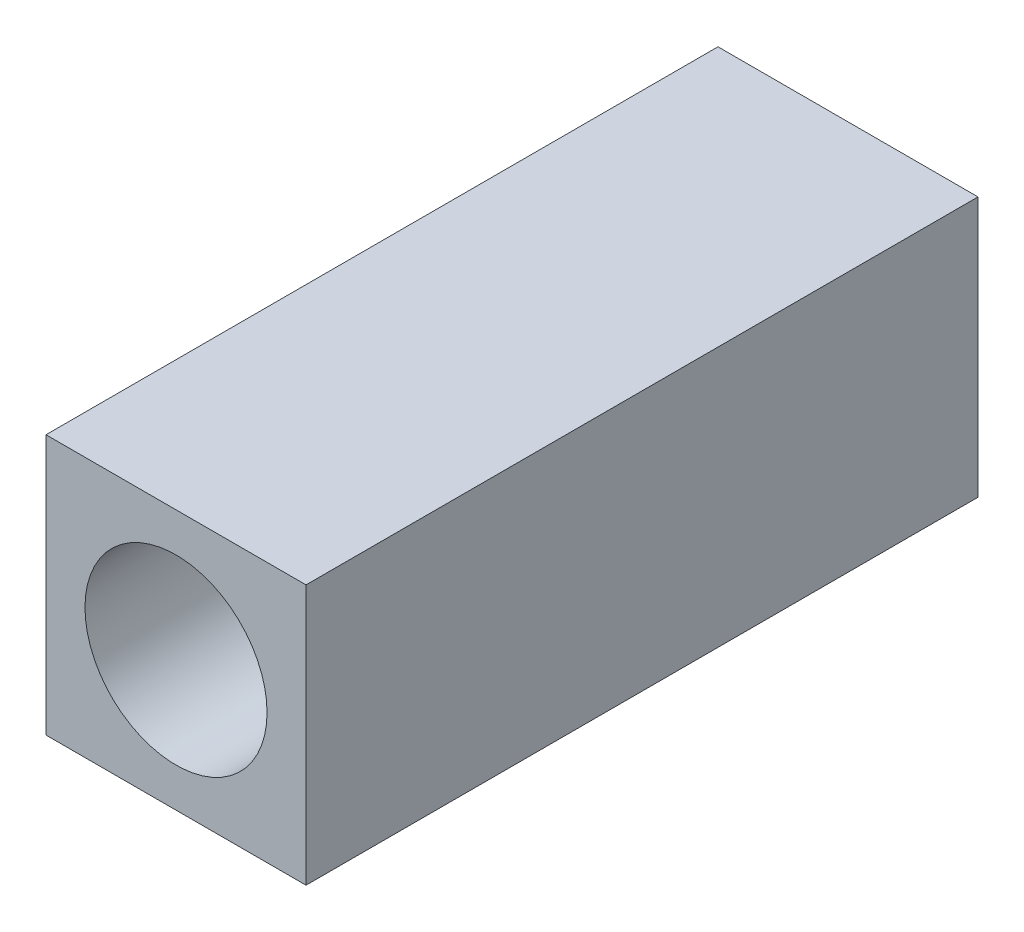
ISO-10303-21;
HEADER;
FILE_DESCRIPTION(('STEP AP214'),'2;1');
FILE_NAME('part.step','',(''),(''),'','','');
FILE_SCHEMA(('AUTOMOTIVE_DESIGN { 1 0 10303 214 1 1 1 1 }'));
ENDSEC;
DATA;
#1=APPLICATION_CONTEXT('core data for automotive mechanical design processes');
#2=APPLICATION_PROTOCOL_DEFINITION('international standard','automotive_design',2000,#1);
#3=PRODUCT_CONTEXT('',#1,'mechanical');
#4=PRODUCT('Part','Part','',(#3));
#5=PRODUCT_RELATED_PRODUCT_CATEGORY('part','',(#4));
#6=PRODUCT_DEFINITION_FORMATION('','',#4);
#7=PRODUCT_DEFINITION_CONTEXT('part definition',#1,'design');
#8=PRODUCT_DEFINITION('design','',#6,#7);
#9=PRODUCT_DEFINITION_SHAPE('','',#8);
#10=(LENGTH_UNIT() NAMED_UNIT(*) SI_UNIT(.MILLI.,.METRE.));
#11=(NAMED_UNIT(*) PLANE_ANGLE_UNIT() SI_UNIT($,.RADIAN.));
#12=(NAMED_UNIT(*) SI_UNIT($,.STERADIAN.) SOLID_ANGLE_UNIT());
#13=UNCERTAINTY_MEASURE_WITH_UNIT(LENGTH_MEASURE(1.E-05),#10,'distance_accuracy_value','');
#14=(GEOMETRIC_REPRESENTATION_CONTEXT(3) GLOBAL_UNCERTAINTY_ASSIGNED_CONTEXT((#13)) GLOBAL_UNIT_ASSIGNED_CONTEXT((#10,
#11,#12)) REPRESENTATION_CONTEXT('',''));
#15=CARTESIAN_POINT('',(0.,0.,0.));
#16=DIRECTION('',(0.,0.,1.));
#17=DIRECTION('',(1.,0.,0.));
#18=AXIS2_PLACEMENT_3D('',#15,#16,#17);
#19=CARTESIAN_POINT('',(-2.99895518302224,0.,16.));
#20=DIRECTION('',(-1.,0.,0.));
#21=DIRECTION('',(0.,0.,1.));
#22=AXIS2_PLACEMENT_3D('',#19,#20,#21);
#23=PLANE('',#22);
#24=DIRECTION('',(0.,0.,-1.));
#25=VECTOR('',#24,1.);
#26=CARTESIAN_POINT('',(-2.99895518302224,3.,16.));
#27=LINE('',#26,#25);
#28=CARTESIAN_POINT('',(-2.99895518302224,3.,16.));
#29=VERTEX_POINT('',#28);
#30=CARTESIAN_POINT('',(-2.99895518302224,3.,0.5));
#31=VERTEX_POINT('',#30);
#32=EDGE_CURVE('E120',#29,#31,#27,.T.);
#33=ORIENTED_EDGE('',*,*,#32,.T.);
#34=DIRECTION('',(0.,-1.,0.));
#35=VECTOR('',#34,1.);
#36=CARTESIAN_POINT('',(-2.99895518302224,-3.,0.5));
#37=LINE('',#36,#35);
#38=CARTESIAN_POINT('',(-2.99895518302224,-3.,0.5));
#39=VERTEX_POINT('',#38);
#40=EDGE_CURVE('E138',#31,#39,#37,.T.);
#41=ORIENTED_EDGE('',*,*,#40,.T.);
#42=DIRECTION('',(0.,0.,-1.));
#43=VECTOR('',#42,1.);
#44=CARTESIAN_POINT('',(-2.99895518302224,-3.,16.));
#45=LINE('',#44,#43);
#46=CARTESIAN_POINT('',(-2.99895518302224,-3.,16.));
#47=VERTEX_POINT('',#46);
#48=EDGE_CURVE('E127',#47,#39,#45,.T.);
#49=ORIENTED_EDGE('',*,*,#48,.F.);
#50=DIRECTION('',(0.,1.,0.));
#51=VECTOR('',#50,1.);
#52=CARTESIAN_POINT('',(-2.99895518302224,0.,16.));
#53=LINE('',#52,#51);
#54=EDGE_CURVE('E105',#47,#29,#53,.T.);
#55=ORIENTED_EDGE('',*,*,#54,.T.);
#56=EDGE_LOOP('',(#33,#41,#49,#55));
#57=FACE_BOUND('',#56,.T.);
#58=ADVANCED_FACE('F38',(#57),#23,.T.);
#59=CARTESIAN_POINT('',(0.,-3.,16.));
#60=DIRECTION('',(0.,1.,0.));
#61=DIRECTION('',(0.,0.,1.));
#62=AXIS2_PLACEMENT_3D('',#59,#60,#61);
#63=PLANE('',#62);
#64=ORIENTED_EDGE('',*,*,#48,.T.);
#65=DIRECTION('',(1.,0.,0.));
#66=VECTOR('',#65,1.);
#67=CARTESIAN_POINT('',(0.,-3.,0.5));
#68=LINE('',#67,#66);
#69=CARTESIAN_POINT('',(2.99895518302224,-3.,0.5));
#70=VERTEX_POINT('',#69);
#71=EDGE_CURVE('E62',#39,#70,#68,.T.);
#72=ORIENTED_EDGE('',*,*,#71,.T.);
#73=DIRECTION('',(0.,0.,-1.));
#74=VECTOR('',#73,1.);
#75=CARTESIAN_POINT('',(2.99895518302224,-3.,16.));
#76=LINE('',#75,#74);
#77=CARTESIAN_POINT('',(2.99895518302224,-3.,16.));
#78=VERTEX_POINT('',#77);
#79=EDGE_CURVE('E125',#78,#70,#76,.T.);
#80=ORIENTED_EDGE('',*,*,#79,.F.);
#81=DIRECTION('',(1.,0.,0.));
#82=VECTOR('',#81,1.);
#83=CARTESIAN_POINT('',(0.,-3.,16.));
#84=LINE('',#83,#82);
#85=EDGE_CURVE('E109',#47,#78,#84,.T.);
#86=ORIENTED_EDGE('',*,*,#85,.F.);
#87=EDGE_LOOP('',(#64,#72,#80,#86));
#88=FACE_BOUND('',#87,.T.);
#89=ADVANCED_FACE('F182',(#88),#63,.F.);
#90=CARTESIAN_POINT('',(2.99895518302224,0.,16.));
#91=DIRECTION('',(-1.,0.,0.));
#92=DIRECTION('',(0.,0.,1.));
#93=AXIS2_PLACEMENT_3D('',#90,#91,#92);
#94=PLANE('',#93);
#95=ORIENTED_EDGE('',*,*,#79,.T.);
#96=DIRECTION('',(0.,1.,0.));
#97=VECTOR('',#96,1.);
#98=CARTESIAN_POINT('',(2.99895518302224,0.,0.5));
#99=LINE('',#98,#97);
#100=CARTESIAN_POINT('',(2.99895518302224,3.,0.5));
#101=VERTEX_POINT('',#100);
#102=EDGE_CURVE('E47',#70,#101,#99,.T.);
#103=ORIENTED_EDGE('',*,*,#102,.T.);
#104=DIRECTION('',(0.,0.,-1.));
#105=VECTOR('',#104,1.);
#106=CARTESIAN_POINT('',(2.99895518302224,3.,16.));
#107=LINE('',#106,#105);
#108=CARTESIAN_POINT('',(2.99895518302224,3.,16.));
#109=VERTEX_POINT('',#108);
#110=EDGE_CURVE('E123',#109,#101,#107,.T.);
#111=ORIENTED_EDGE('',*,*,#110,.F.);
#112=DIRECTION('',(0.,1.,0.));
#113=VECTOR('',#112,1.);
#114=CARTESIAN_POINT('',(2.99895518302224,0.,16.));
#115=LINE('',#114,#113);
#116=EDGE_CURVE('E115',#78,#109,#115,.T.);
#117=ORIENTED_EDGE('',*,*,#116,.F.);
#118=EDGE_LOOP('',(#95,#103,#111,#117));
#119=FACE_BOUND('',#118,.T.);
#120=ADVANCED_FACE('F187',(#119),#94,.F.);
#121=CARTESIAN_POINT('',(0.,3.,16.));
#122=DIRECTION('',(0.,1.,0.));
#123=DIRECTION('',(0.,0.,1.));
#124=AXIS2_PLACEMENT_3D('',#121,#122,#123);
#125=PLANE('',#124);
#126=ORIENTED_EDGE('',*,*,#110,.T.);
#127=DIRECTION('',(-1.,0.,0.));
#128=VECTOR('',#127,1.);
#129=CARTESIAN_POINT('',(-2.99895518302224,3.,0.5));
#130=LINE('',#129,#128);
#131=EDGE_CURVE('E11',#101,#31,#130,.T.);
#132=ORIENTED_EDGE('',*,*,#131,.T.);
#133=ORIENTED_EDGE('',*,*,#32,.F.);
#134=DIRECTION('',(1.,0.,0.));
#135=VECTOR('',#134,1.);
#136=CARTESIAN_POINT('',(0.,3.,16.));
#137=LINE('',#136,#135);
#138=EDGE_CURVE('E117',#29,#109,#137,.T.);
#139=ORIENTED_EDGE('',*,*,#138,.T.);
#140=EDGE_LOOP('',(#126,#132,#133,#139));
#141=FACE_BOUND('',#140,.T.);
#142=ADVANCED_FACE('F163',(#141),#125,.T.);
#143=CARTESIAN_POINT('',(0.,0.,16.));
#144=DIRECTION('',(0.,0.,1.));
#145=DIRECTION('',(1.,0.,0.));
#146=AXIS2_PLACEMENT_3D('',#143,#144,#145);
#147=PLANE('',#146);
#148=CARTESIAN_POINT('',(0.,0.,16.));
#149=DIRECTION('',(0.,0.,1.));
#150=DIRECTION('',(1.,0.,0.));
#151=AXIS2_PLACEMENT_3D('',#148,#149,#150);
#152=CIRCLE('',#151,2.09999999999999);
#153=CARTESIAN_POINT('',(2.09999999999999,0.,16.));
#154=VERTEX_POINT('',#153);
#155=EDGE_CURVE('E106',#154,#154,#152,.T.);
#156=ORIENTED_EDGE('',*,*,#155,.F.);
#157=EDGE_LOOP('',(#156));
#158=FACE_BOUND('',#157,.T.);
#159=ORIENTED_EDGE('',*,*,#54,.F.);
#160=ORIENTED_EDGE('',*,*,#85,.T.);
#161=ORIENTED_EDGE('',*,*,#116,.T.);
#162=ORIENTED_EDGE('',*,*,#138,.F.);
#163=EDGE_LOOP('',(#159,#160,#161,#162));
#164=FACE_BOUND('',#163,.T.);
#165=ADVANCED_FACE('F173',(#158,#164),#147,.T.);
#166=CARTESIAN_POINT('',(0.,0.,0.));
#167=DIRECTION('',(0.,0.,1.));
#168=DIRECTION('',(1.,0.,0.));
#169=AXIS2_PLACEMENT_3D('',#166,#167,#168);
#170=PLANE('',#169);
#171=DIRECTION('',(-1.,0.,0.));
#172=VECTOR('',#171,1.);
#173=CARTESIAN_POINT('',(0.,-2.5,0.));
#174=LINE('',#173,#172);
#175=CARTESIAN_POINT('',(2.49895518302224,-2.5,0.));
#176=VERTEX_POINT('',#175);
#177=CARTESIAN_POINT('',(-2.49895518302224,-2.5,0.));
#178=VERTEX_POINT('',#177);
#179=EDGE_CURVE('E133',#176,#178,#174,.T.);
#180=ORIENTED_EDGE('',*,*,#179,.T.);
#181=DIRECTION('',(0.,1.,0.));
#182=VECTOR('',#181,1.);
#183=CARTESIAN_POINT('',(-2.49895518302224,3.,0.));
#184=LINE('',#183,#182);
#185=CARTESIAN_POINT('',(-2.49895518302224,2.5,0.));
#186=VERTEX_POINT('',#185);
#187=EDGE_CURVE('E135',#178,#186,#184,.T.);
#188=ORIENTED_EDGE('',*,*,#187,.T.);
#189=DIRECTION('',(1.,0.,0.));
#190=VECTOR('',#189,1.);
#191=CARTESIAN_POINT('',(2.99895518302224,2.5,0.));
#192=LINE('',#191,#190);
#193=CARTESIAN_POINT('',(2.49895518302224,2.5,0.));
#194=VERTEX_POINT('',#193);
#195=EDGE_CURVE('E129',#186,#194,#192,.T.);
#196=ORIENTED_EDGE('',*,*,#195,.T.);
#197=DIRECTION('',(0.,-1.,0.));
#198=VECTOR('',#197,1.);
#199=CARTESIAN_POINT('',(2.49895518302224,0.,0.));
#200=LINE('',#199,#198);
#201=EDGE_CURVE('E131',#194,#176,#200,.T.);
#202=ORIENTED_EDGE('',*,*,#201,.T.);
#203=EDGE_LOOP('',(#180,#188,#196,#202));
#204=FACE_BOUND('',#203,.T.);
#205=ADVANCED_FACE('F99',(#204),#170,.F.);
#206=CARTESIAN_POINT('',(0.,0.,2.));
#207=DIRECTION('',(0.,0.,1.));
#208=DIRECTION('',(1.,0.,0.));
#209=AXIS2_PLACEMENT_3D('',#206,#207,#208);
#210=CONICAL_SURFACE('',#209,2.1,1.02974425867665);
#211=CARTESIAN_POINT('',(0.,0.,0.738192700042125));
#212=VERTEX_POINT('',#211);
#213=VERTEX_LOOP('',#212);
#214=FACE_BOUND('',#213,.T.);
#215=CARTESIAN_POINT('',(0.,0.,2.));
#216=DIRECTION('',(0.,0.,1.));
#217=DIRECTION('',(1.,0.,0.));
#218=AXIS2_PLACEMENT_3D('',#215,#216,#217);
#219=CIRCLE('',#218,2.1);
#220=CARTESIAN_POINT('',(2.1,0.,2.));
#221=VERTEX_POINT('',#220);
#222=EDGE_CURVE('E103',#221,#221,#219,.T.);
#223=ORIENTED_EDGE('',*,*,#222,.T.);
#224=EDGE_LOOP('',(#223));
#225=FACE_BOUND('',#224,.T.);
#226=ADVANCED_FACE('F95',(#214,#225),#210,.F.);
#227=CARTESIAN_POINT('',(0.,0.,16.));
#228=DIRECTION('',(0.,0.,1.));
#229=DIRECTION('',(1.,0.,0.));
#230=AXIS2_PLACEMENT_3D('',#227,#228,#229);
#231=CYLINDRICAL_SURFACE('',#230,2.09999999999999);
#232=ORIENTED_EDGE('',*,*,#222,.F.);
#233=EDGE_LOOP('',(#232));
#234=FACE_BOUND('',#233,.T.);
#235=ORIENTED_EDGE('',*,*,#155,.T.);
#236=EDGE_LOOP('',(#235));
#237=FACE_BOUND('',#236,.T.);
#238=ADVANCED_FACE('F98',(#234,#237),#231,.F.);
#239=CARTESIAN_POINT('',(2.99895518302224,0.,0.5));
#240=DIRECTION('',(-0.70710678118655,0.,0.707106781186545));
#241=DIRECTION('',(0.,1.,0.));
#242=AXIS2_PLACEMENT_3D('',#239,#240,#241);
#243=PLANE('',#242);
#244=DIRECTION('',(0.577350269189624,0.577350269189624,0.577350269189628));
#245=VECTOR('',#244,1.);
#246=CARTESIAN_POINT('',(1.66597012201483,1.66701493899259,-0.832985061007416));
#247=LINE('',#246,#245);
#248=EDGE_CURVE('E146',#101,#194,#247,.F.);
#249=ORIENTED_EDGE('',*,*,#248,.F.);
#250=ORIENTED_EDGE('',*,*,#102,.F.);
#251=DIRECTION('',(-0.577350269189624,0.577350269189624,-0.577350269189628));
#252=VECTOR('',#251,1.);
#253=CARTESIAN_POINT('',(1.99895518302224,-2.,-0.500000000000002));
#254=LINE('',#253,#252);
#255=EDGE_CURVE('E42',#176,#70,#254,.F.);
#256=ORIENTED_EDGE('',*,*,#255,.F.);
#257=ORIENTED_EDGE('',*,*,#201,.F.);
#258=EDGE_LOOP('',(#249,#250,#256,#257));
#259=FACE_BOUND('',#258,.T.);
#260=ADVANCED_FACE('F40',(#259),#243,.F.);
#261=CARTESIAN_POINT('',(0.,-3.,0.5));
#262=DIRECTION('',(0.,0.70710678118655,0.707106781186545));
#263=DIRECTION('',(1.,0.,0.));
#264=AXIS2_PLACEMENT_3D('',#261,#262,#263);
#265=PLANE('',#264);
#266=ORIENTED_EDGE('',*,*,#255,.T.);
#267=ORIENTED_EDGE('',*,*,#71,.F.);
#268=DIRECTION('',(-0.577350269189624,-0.577350269189624,0.577350269189628));
#269=VECTOR('',#268,1.);
#270=CARTESIAN_POINT('',(-1.99930345534816,-2.00034827232592,-0.499651727674082));
#271=LINE('',#270,#269);
#272=EDGE_CURVE('E145',#178,#39,#271,.T.);
#273=ORIENTED_EDGE('',*,*,#272,.F.);
#274=ORIENTED_EDGE('',*,*,#179,.F.);
#275=EDGE_LOOP('',(#266,#267,#273,#274));
#276=FACE_BOUND('',#275,.T.);
#277=ADVANCED_FACE('F156',(#276),#265,.F.);
#278=CARTESIAN_POINT('',(0.,2.5,0.));
#279=DIRECTION('',(0.,0.70710678118655,-0.707106781186545));
#280=DIRECTION('',(-1.,0.,0.));
#281=AXIS2_PLACEMENT_3D('',#278,#279,#280);
#282=PLANE('',#281);
#283=ORIENTED_EDGE('',*,*,#248,.T.);
#284=ORIENTED_EDGE('',*,*,#195,.F.);
#285=DIRECTION('',(-0.577350269189624,0.577350269189624,0.577350269189628));
#286=VECTOR('',#285,1.);
#287=CARTESIAN_POINT('',(-1.66597012201483,1.66701493899259,-0.832985061007416));
#288=LINE('',#287,#286);
#289=EDGE_CURVE('E143',#31,#186,#288,.F.);
#290=ORIENTED_EDGE('',*,*,#289,.F.);
#291=ORIENTED_EDGE('',*,*,#131,.F.);
#292=EDGE_LOOP('',(#283,#284,#290,#291));
#293=FACE_BOUND('',#292,.T.);
#294=ADVANCED_FACE('F161',(#293),#282,.T.);
#295=CARTESIAN_POINT('',(-2.49895518302224,0.,0.));
#296=DIRECTION('',(-0.70710678118655,0.,-0.707106781186545));
#297=DIRECTION('',(0.,-1.,0.));
#298=AXIS2_PLACEMENT_3D('',#295,#296,#297);
#299=PLANE('',#298);
#300=ORIENTED_EDGE('',*,*,#272,.T.);
#301=ORIENTED_EDGE('',*,*,#40,.F.);
#302=ORIENTED_EDGE('',*,*,#289,.T.);
#303=ORIENTED_EDGE('',*,*,#187,.F.);
#304=EDGE_LOOP('',(#300,#301,#302,#303));
#305=FACE_BOUND('',#304,.T.);
#306=ADVANCED_FACE('F169',(#305),#299,.T.);
#307=CLOSED_SHELL('',(#58,#89,#120,#142,#165,#205,#226,#238,#260,#277,#294,#306));
#308=MANIFOLD_SOLID_BREP('B2',#307);
#309=ADVANCED_BREP_SHAPE_REPRESENTATION('',(#18,#308),#14);
#310=SHAPE_DEFINITION_REPRESENTATION(#9,#309);
ENDSEC;
END-ISO-10303-21;
